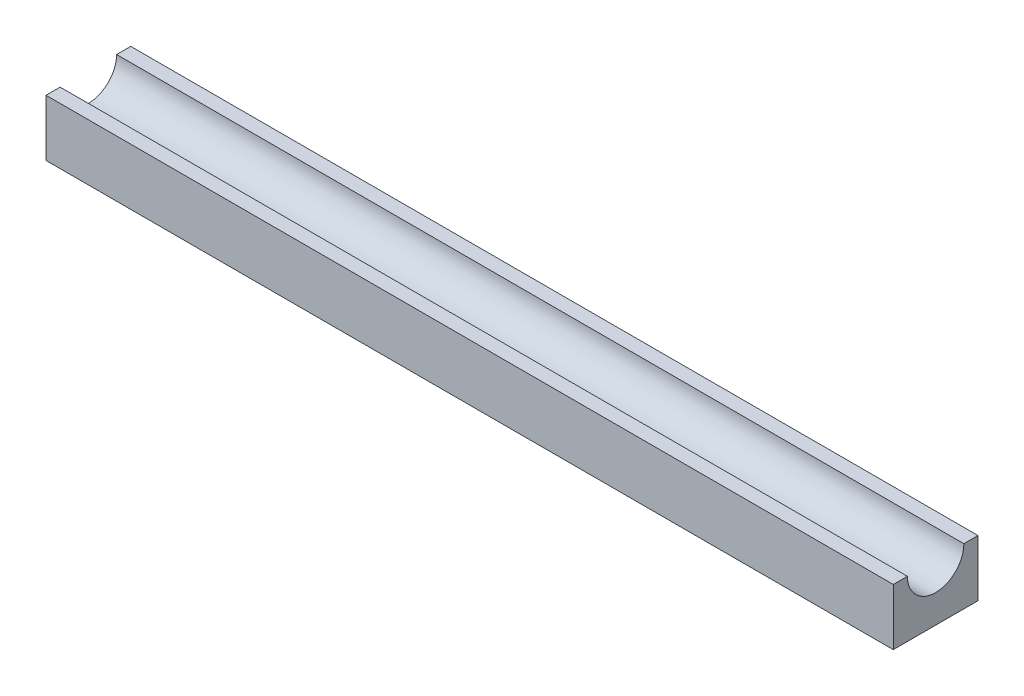
ISO-10303-21;
HEADER;
FILE_DESCRIPTION(('STEP AP214'),'2;1');
FILE_NAME('part.step','',(''),(''),'','','');
FILE_SCHEMA(('AUTOMOTIVE_DESIGN { 1 0 10303 214 1 1 1 1 }'));
ENDSEC;
DATA;
#1=APPLICATION_CONTEXT('core data for automotive mechanical design processes');
#2=APPLICATION_PROTOCOL_DEFINITION('international standard','automotive_design',2000,#1);
#3=PRODUCT_CONTEXT('',#1,'mechanical');
#4=PRODUCT('Part','Part','',(#3));
#5=PRODUCT_RELATED_PRODUCT_CATEGORY('part','',(#4));
#6=PRODUCT_DEFINITION_FORMATION('','',#4);
#7=PRODUCT_DEFINITION_CONTEXT('part definition',#1,'design');
#8=PRODUCT_DEFINITION('design','',#6,#7);
#9=PRODUCT_DEFINITION_SHAPE('','',#8);
#10=(LENGTH_UNIT() NAMED_UNIT(*) SI_UNIT(.MILLI.,.METRE.));
#11=(NAMED_UNIT(*) PLANE_ANGLE_UNIT() SI_UNIT($,.RADIAN.));
#12=(NAMED_UNIT(*) SI_UNIT($,.STERADIAN.) SOLID_ANGLE_UNIT());
#13=UNCERTAINTY_MEASURE_WITH_UNIT(LENGTH_MEASURE(1.E-05),#10,'distance_accuracy_value','');
#14=(GEOMETRIC_REPRESENTATION_CONTEXT(3) GLOBAL_UNCERTAINTY_ASSIGNED_CONTEXT((#13)) GLOBAL_UNIT_ASSIGNED_CONTEXT((#10,
#11,#12)) REPRESENTATION_CONTEXT('',''));
#15=CARTESIAN_POINT('',(0.,0.,0.));
#16=DIRECTION('',(0.,0.,1.));
#17=DIRECTION('',(1.,0.,0.));
#18=AXIS2_PLACEMENT_3D('',#15,#16,#17);
#19=CARTESIAN_POINT('',(150.,5.,0.));
#20=DIRECTION('',(-1.,0.,0.));
#21=DIRECTION('',(0.,0.,1.));
#22=AXIS2_PLACEMENT_3D('',#19,#20,#21);
#23=CYLINDRICAL_SURFACE('',#22,5.);
#24=CARTESIAN_POINT('',(0.,5.,0.));
#25=DIRECTION('',(1.,0.,0.));
#26=DIRECTION('',(0.,0.,-1.));
#27=AXIS2_PLACEMENT_3D('',#24,#25,#26);
#28=CIRCLE('',#27,5.);
#29=CARTESIAN_POINT('',(0.,5.,5.));
#30=VERTEX_POINT('',#29);
#31=CARTESIAN_POINT('',(0.,5.,-5.));
#32=VERTEX_POINT('',#31);
#33=EDGE_CURVE('E231',#30,#32,#28,.T.);
#34=ORIENTED_EDGE('',*,*,#33,.F.);
#35=DIRECTION('',(-1.,0.,0.));
#36=VECTOR('',#35,1.);
#37=CARTESIAN_POINT('',(150.,5.,5.));
#38=LINE('',#37,#36);
#39=CARTESIAN_POINT('',(150.,5.,5.));
#40=VERTEX_POINT('',#39);
#41=EDGE_CURVE('E11',#40,#30,#38,.T.);
#42=ORIENTED_EDGE('',*,*,#41,.F.);
#43=CARTESIAN_POINT('',(150.,5.,0.));
#44=DIRECTION('',(1.,0.,0.));
#45=DIRECTION('',(0.,0.,-1.));
#46=AXIS2_PLACEMENT_3D('',#43,#44,#45);
#47=CIRCLE('',#46,5.);
#48=CARTESIAN_POINT('',(150.,5.,-5.));
#49=VERTEX_POINT('',#48);
#50=EDGE_CURVE('E232',#40,#49,#47,.T.);
#51=ORIENTED_EDGE('',*,*,#50,.T.);
#52=DIRECTION('',(-1.,0.,0.));
#53=VECTOR('',#52,1.);
#54=CARTESIAN_POINT('',(150.,5.,-5.));
#55=LINE('',#54,#53);
#56=EDGE_CURVE('E270',#49,#32,#55,.T.);
#57=ORIENTED_EDGE('',*,*,#56,.T.);
#58=EDGE_LOOP('',(#34,#42,#51,#57));
#59=FACE_BOUND('',#58,.T.);
#60=ADVANCED_FACE('F40',(#59),#23,.F.);
#61=CARTESIAN_POINT('',(150.,5.,0.));
#62=DIRECTION('',(0.,1.,0.));
#63=DIRECTION('',(0.,0.,1.));
#64=AXIS2_PLACEMENT_3D('',#61,#62,#63);
#65=PLANE('',#64);
#66=DIRECTION('',(0.,0.,-1.));
#67=VECTOR('',#66,1.);
#68=CARTESIAN_POINT('',(0.,5.,0.));
#69=LINE('',#68,#67);
#70=CARTESIAN_POINT('',(0.,5.,7.5));
#71=VERTEX_POINT('',#70);
#72=EDGE_CURVE('E255',#71,#30,#69,.T.);
#73=ORIENTED_EDGE('',*,*,#72,.F.);
#74=DIRECTION('',(-1.,0.,0.));
#75=VECTOR('',#74,1.);
#76=CARTESIAN_POINT('',(150.,5.,7.5));
#77=LINE('',#76,#75);
#78=CARTESIAN_POINT('',(150.,5.,7.5));
#79=VERTEX_POINT('',#78);
#80=EDGE_CURVE('E49',#79,#71,#77,.T.);
#81=ORIENTED_EDGE('',*,*,#80,.F.);
#82=DIRECTION('',(0.,0.,-1.));
#83=VECTOR('',#82,1.);
#84=CARTESIAN_POINT('',(150.,5.,0.));
#85=LINE('',#84,#83);
#86=EDGE_CURVE('E236',#79,#40,#85,.T.);
#87=ORIENTED_EDGE('',*,*,#86,.T.);
#88=ORIENTED_EDGE('',*,*,#41,.T.);
#89=EDGE_LOOP('',(#73,#81,#87,#88));
#90=FACE_BOUND('',#89,.T.);
#91=ADVANCED_FACE('F328',(#90),#65,.T.);
#92=CARTESIAN_POINT('',(150.,0.,7.5));
#93=DIRECTION('',(0.,0.,-1.));
#94=DIRECTION('',(0.,1.,0.));
#95=AXIS2_PLACEMENT_3D('',#92,#93,#94);
#96=PLANE('',#95);
#97=DIRECTION('',(0.,-1.,0.));
#98=VECTOR('',#97,1.);
#99=CARTESIAN_POINT('',(0.,0.,7.5));
#100=LINE('',#99,#98);
#101=CARTESIAN_POINT('',(0.,-5.,7.5));
#102=VERTEX_POINT('',#101);
#103=EDGE_CURVE('E259',#71,#102,#100,.T.);
#104=ORIENTED_EDGE('',*,*,#103,.T.);
#105=DIRECTION('',(-1.,0.,0.));
#106=VECTOR('',#105,1.);
#107=CARTESIAN_POINT('',(150.,-5.,7.5));
#108=LINE('',#107,#106);
#109=CARTESIAN_POINT('',(150.,-5.,7.5));
#110=VERTEX_POINT('',#109);
#111=EDGE_CURVE('E279',#110,#102,#108,.T.);
#112=ORIENTED_EDGE('',*,*,#111,.F.);
#113=DIRECTION('',(0.,-1.,0.));
#114=VECTOR('',#113,1.);
#115=CARTESIAN_POINT('',(150.,0.,7.5));
#116=LINE('',#115,#114);
#117=EDGE_CURVE('E241',#79,#110,#116,.T.);
#118=ORIENTED_EDGE('',*,*,#117,.F.);
#119=ORIENTED_EDGE('',*,*,#80,.T.);
#120=EDGE_LOOP('',(#104,#112,#118,#119));
#121=FACE_BOUND('',#120,.T.);
#122=ADVANCED_FACE('F333',(#121),#96,.F.);
#123=CARTESIAN_POINT('',(150.,-5.,0.));
#124=DIRECTION('',(0.,1.,0.));
#125=DIRECTION('',(0.,0.,1.));
#126=AXIS2_PLACEMENT_3D('',#123,#124,#125);
#127=PLANE('',#126);
#128=DIRECTION('',(0.,0.,-1.));
#129=VECTOR('',#128,1.);
#130=CARTESIAN_POINT('',(12.5,-5.00000000000001,1.5));
#131=LINE('',#130,#129);
#132=CARTESIAN_POINT('',(12.5,-5.,1.5));
#133=VERTEX_POINT('',#132);
#134=CARTESIAN_POINT('',(12.5,-5.,-1.5));
#135=VERTEX_POINT('',#134);
#136=EDGE_CURVE('E62',#133,#135,#131,.T.);
#137=ORIENTED_EDGE('',*,*,#136,.F.);
#138=DIRECTION('',(-1.,0.,0.));
#139=VECTOR('',#138,1.);
#140=CARTESIAN_POINT('',(90.,-5.00000000000001,1.50000000000001));
#141=LINE('',#140,#139);
#142=CARTESIAN_POINT('',(17.5,-5.,1.5));
#143=VERTEX_POINT('',#142);
#144=EDGE_CURVE('E57',#143,#133,#141,.T.);
#145=ORIENTED_EDGE('',*,*,#144,.F.);
#146=DIRECTION('',(0.,0.,-1.));
#147=VECTOR('',#146,1.);
#148=CARTESIAN_POINT('',(17.5,-5.00000000000001,1.5));
#149=LINE('',#148,#147);
#150=CARTESIAN_POINT('',(17.5,-5.00000000000001,-1.5));
#151=VERTEX_POINT('',#150);
#152=EDGE_CURVE('E184',#143,#151,#149,.T.);
#153=ORIENTED_EDGE('',*,*,#152,.T.);
#154=DIRECTION('',(-1.,0.,0.));
#155=VECTOR('',#154,1.);
#156=CARTESIAN_POINT('',(90.,-5.00000000000001,-1.49999999999999));
#157=LINE('',#156,#155);
#158=EDGE_CURVE('E172',#151,#135,#157,.T.);
#159=ORIENTED_EDGE('',*,*,#158,.T.);
#160=EDGE_LOOP('',(#137,#145,#153,#159));
#161=FACE_BOUND('',#160,.T.);
#162=DIRECTION('',(0.,0.,-1.));
#163=VECTOR('',#162,1.);
#164=CARTESIAN_POINT('',(72.5,-5.00000000000001,1.5));
#165=LINE('',#164,#163);
#166=CARTESIAN_POINT('',(72.5,-5.,1.5));
#167=VERTEX_POINT('',#166);
#168=CARTESIAN_POINT('',(72.5,-5.,-1.5));
#169=VERTEX_POINT('',#168);
#170=EDGE_CURVE('E203',#167,#169,#165,.T.);
#171=ORIENTED_EDGE('',*,*,#170,.F.);
#172=DIRECTION('',(1.,0.,0.));
#173=VECTOR('',#172,1.);
#174=CARTESIAN_POINT('',(0.,-5.00000000000001,1.5));
#175=LINE('',#174,#173);
#176=CARTESIAN_POINT('',(77.5,-5.,1.5));
#177=VERTEX_POINT('',#176);
#178=EDGE_CURVE('E200',#167,#177,#175,.T.);
#179=ORIENTED_EDGE('',*,*,#178,.T.);
#180=DIRECTION('',(0.,0.,-1.));
#181=VECTOR('',#180,1.);
#182=CARTESIAN_POINT('',(77.5,-5.00000000000001,1.5));
#183=LINE('',#182,#181);
#184=CARTESIAN_POINT('',(77.5,-5.00000000000001,-1.5));
#185=VERTEX_POINT('',#184);
#186=EDGE_CURVE('E221',#177,#185,#183,.T.);
#187=ORIENTED_EDGE('',*,*,#186,.T.);
#188=DIRECTION('',(1.,0.,0.));
#189=VECTOR('',#188,1.);
#190=CARTESIAN_POINT('',(0.,-5.00000000000001,-1.5));
#191=LINE('',#190,#189);
#192=EDGE_CURVE('E193',#169,#185,#191,.T.);
#193=ORIENTED_EDGE('',*,*,#192,.F.);
#194=EDGE_LOOP('',(#171,#179,#187,#193));
#195=FACE_BOUND('',#194,.T.);
#196=DIRECTION('',(0.,0.,-1.));
#197=VECTOR('',#196,1.);
#198=CARTESIAN_POINT('',(0.,-5.,0.));
#199=LINE('',#198,#197);
#200=CARTESIAN_POINT('',(0.,-5.,-7.5));
#201=VERTEX_POINT('',#200);
#202=EDGE_CURVE('E262',#102,#201,#199,.T.);
#203=ORIENTED_EDGE('',*,*,#202,.T.);
#204=DIRECTION('',(-1.,0.,0.));
#205=VECTOR('',#204,1.);
#206=CARTESIAN_POINT('',(150.,-5.,-7.5));
#207=LINE('',#206,#205);
#208=CARTESIAN_POINT('',(150.,-5.,-7.5));
#209=VERTEX_POINT('',#208);
#210=EDGE_CURVE('E276',#209,#201,#207,.T.);
#211=ORIENTED_EDGE('',*,*,#210,.F.);
#212=DIRECTION('',(0.,0.,-1.));
#213=VECTOR('',#212,1.);
#214=CARTESIAN_POINT('',(150.,-5.,0.));
#215=LINE('',#214,#213);
#216=EDGE_CURVE('E245',#110,#209,#215,.T.);
#217=ORIENTED_EDGE('',*,*,#216,.F.);
#218=ORIENTED_EDGE('',*,*,#111,.T.);
#219=EDGE_LOOP('',(#203,#211,#217,#218));
#220=FACE_BOUND('',#219,.T.);
#221=ADVANCED_FACE('F309',(#161,#195,#220),#127,.F.);
#222=CARTESIAN_POINT('',(150.,0.,-7.5));
#223=DIRECTION('',(0.,0.,-1.));
#224=DIRECTION('',(0.,1.,0.));
#225=AXIS2_PLACEMENT_3D('',#222,#223,#224);
#226=PLANE('',#225);
#227=DIRECTION('',(0.,-1.,0.));
#228=VECTOR('',#227,1.);
#229=CARTESIAN_POINT('',(0.,0.,-7.5));
#230=LINE('',#229,#228);
#231=CARTESIAN_POINT('',(0.,5.,-7.5));
#232=VERTEX_POINT('',#231);
#233=EDGE_CURVE('E266',#232,#201,#230,.T.);
#234=ORIENTED_EDGE('',*,*,#233,.F.);
#235=DIRECTION('',(-1.,0.,0.));
#236=VECTOR('',#235,1.);
#237=CARTESIAN_POINT('',(150.,5.,-7.5));
#238=LINE('',#237,#236);
#239=CARTESIAN_POINT('',(150.,5.,-7.5));
#240=VERTEX_POINT('',#239);
#241=EDGE_CURVE('E273',#240,#232,#238,.T.);
#242=ORIENTED_EDGE('',*,*,#241,.F.);
#243=DIRECTION('',(0.,-1.,0.));
#244=VECTOR('',#243,1.);
#245=CARTESIAN_POINT('',(150.,0.,-7.5));
#246=LINE('',#245,#244);
#247=EDGE_CURVE('E248',#240,#209,#246,.T.);
#248=ORIENTED_EDGE('',*,*,#247,.T.);
#249=ORIENTED_EDGE('',*,*,#210,.T.);
#250=EDGE_LOOP('',(#234,#242,#248,#249));
#251=FACE_BOUND('',#250,.T.);
#252=ADVANCED_FACE('F359',(#251),#226,.T.);
#253=EDGE_CURVE('E237',#32,#232,#69,.T.);
#254=ORIENTED_EDGE('',*,*,#253,.F.);
#255=ORIENTED_EDGE('',*,*,#56,.F.);
#256=EDGE_CURVE('E242',#49,#240,#85,.T.);
#257=ORIENTED_EDGE('',*,*,#256,.T.);
#258=ORIENTED_EDGE('',*,*,#241,.T.);
#259=EDGE_LOOP('',(#254,#255,#257,#258));
#260=FACE_BOUND('',#259,.T.);
#261=ADVANCED_FACE('F336',(#260),#65,.T.);
#262=CARTESIAN_POINT('',(150.,0.,0.));
#263=DIRECTION('',(1.,0.,0.));
#264=DIRECTION('',(0.,0.,-1.));
#265=AXIS2_PLACEMENT_3D('',#262,#263,#264);
#266=PLANE('',#265);
#267=ORIENTED_EDGE('',*,*,#50,.F.);
#268=ORIENTED_EDGE('',*,*,#86,.F.);
#269=ORIENTED_EDGE('',*,*,#117,.T.);
#270=ORIENTED_EDGE('',*,*,#216,.T.);
#271=ORIENTED_EDGE('',*,*,#247,.F.);
#272=ORIENTED_EDGE('',*,*,#256,.F.);
#273=EDGE_LOOP('',(#267,#268,#269,#270,#271,#272));
#274=FACE_BOUND('',#273,.T.);
#275=ADVANCED_FACE('F349',(#274),#266,.T.);
#276=CARTESIAN_POINT('',(0.,0.,0.));
#277=DIRECTION('',(1.,0.,0.));
#278=DIRECTION('',(0.,0.,-1.));
#279=AXIS2_PLACEMENT_3D('',#276,#277,#278);
#280=PLANE('',#279);
#281=ORIENTED_EDGE('',*,*,#33,.T.);
#282=ORIENTED_EDGE('',*,*,#253,.T.);
#283=ORIENTED_EDGE('',*,*,#233,.T.);
#284=ORIENTED_EDGE('',*,*,#202,.F.);
#285=ORIENTED_EDGE('',*,*,#103,.F.);
#286=ORIENTED_EDGE('',*,*,#72,.T.);
#287=EDGE_LOOP('',(#281,#282,#283,#284,#285,#286));
#288=FACE_BOUND('',#287,.T.);
#289=ADVANCED_FACE('F344',(#288),#280,.F.);
#290=CARTESIAN_POINT('',(72.5,0.,1.5));
#291=DIRECTION('',(1.,0.,0.));
#292=DIRECTION('',(0.,0.,-1.));
#293=AXIS2_PLACEMENT_3D('',#290,#291,#292);
#294=PLANE('',#293);
#295=DIRECTION('',(0.,-1.,0.));
#296=VECTOR('',#295,1.);
#297=CARTESIAN_POINT('',(72.5,0.,-1.5));
#298=LINE('',#297,#296);
#299=CARTESIAN_POINT('',(72.5,-8.,-1.5));
#300=VERTEX_POINT('',#299);
#301=EDGE_CURVE('E187',#169,#300,#298,.T.);
#302=ORIENTED_EDGE('',*,*,#301,.T.);
#303=DIRECTION('',(0.,0.,-1.));
#304=VECTOR('',#303,1.);
#305=CARTESIAN_POINT('',(72.5,-8.,1.5));
#306=LINE('',#305,#304);
#307=CARTESIAN_POINT('',(72.5,-8.,1.5));
#308=VERTEX_POINT('',#307);
#309=EDGE_CURVE('E227',#308,#300,#306,.T.);
#310=ORIENTED_EDGE('',*,*,#309,.F.);
#311=DIRECTION('',(0.,-1.,0.));
#312=VECTOR('',#311,1.);
#313=CARTESIAN_POINT('',(72.5,0.,1.5));
#314=LINE('',#313,#312);
#315=EDGE_CURVE('E188',#167,#308,#314,.T.);
#316=ORIENTED_EDGE('',*,*,#315,.F.);
#317=ORIENTED_EDGE('',*,*,#170,.T.);
#318=EDGE_LOOP('',(#302,#310,#316,#317));
#319=FACE_BOUND('',#318,.T.);
#320=ADVANCED_FACE('F375',(#319),#294,.F.);
#321=CARTESIAN_POINT('',(75.,-8.,1.5));
#322=DIRECTION('',(0.,0.,-1.));
#323=DIRECTION('',(-1.,0.,0.));
#324=AXIS2_PLACEMENT_3D('',#321,#322,#323);
#325=CYLINDRICAL_SURFACE('',#324,2.50000000000001);
#326=CARTESIAN_POINT('',(75.,-8.,-1.5));
#327=DIRECTION('',(0.,0.,1.));
#328=DIRECTION('',(1.,0.,0.));
#329=AXIS2_PLACEMENT_3D('',#326,#327,#328);
#330=CIRCLE('',#329,2.50000000000001);
#331=CARTESIAN_POINT('',(77.5,-8.,-1.5));
#332=VERTEX_POINT('',#331);
#333=EDGE_CURVE('E207',#300,#332,#330,.T.);
#334=ORIENTED_EDGE('',*,*,#333,.T.);
#335=DIRECTION('',(0.,0.,-1.));
#336=VECTOR('',#335,1.);
#337=CARTESIAN_POINT('',(77.5,-8.,1.5));
#338=LINE('',#337,#336);
#339=CARTESIAN_POINT('',(77.5,-8.,1.5));
#340=VERTEX_POINT('',#339);
#341=EDGE_CURVE('E224',#340,#332,#338,.T.);
#342=ORIENTED_EDGE('',*,*,#341,.F.);
#343=CARTESIAN_POINT('',(75.,-8.,1.5));
#344=DIRECTION('',(0.,0.,1.));
#345=DIRECTION('',(1.,0.,0.));
#346=AXIS2_PLACEMENT_3D('',#343,#344,#345);
#347=CIRCLE('',#346,2.50000000000001);
#348=EDGE_CURVE('E192',#308,#340,#347,.T.);
#349=ORIENTED_EDGE('',*,*,#348,.F.);
#350=ORIENTED_EDGE('',*,*,#309,.T.);
#351=EDGE_LOOP('',(#334,#342,#349,#350));
#352=FACE_BOUND('',#351,.T.);
#353=ADVANCED_FACE('F380',(#352),#325,.T.);
#354=CARTESIAN_POINT('',(77.5,0.,1.5));
#355=DIRECTION('',(1.,0.,0.));
#356=DIRECTION('',(0.,0.,-1.));
#357=AXIS2_PLACEMENT_3D('',#354,#355,#356);
#358=PLANE('',#357);
#359=DIRECTION('',(0.,-1.,0.));
#360=VECTOR('',#359,1.);
#361=CARTESIAN_POINT('',(77.5,0.,-1.5));
#362=LINE('',#361,#360);
#363=EDGE_CURVE('E211',#185,#332,#362,.T.);
#364=ORIENTED_EDGE('',*,*,#363,.F.);
#365=ORIENTED_EDGE('',*,*,#186,.F.);
#366=DIRECTION('',(0.,-1.,0.));
#367=VECTOR('',#366,1.);
#368=CARTESIAN_POINT('',(77.5,0.,1.5));
#369=LINE('',#368,#367);
#370=EDGE_CURVE('E196',#177,#340,#369,.T.);
#371=ORIENTED_EDGE('',*,*,#370,.T.);
#372=ORIENTED_EDGE('',*,*,#341,.T.);
#373=EDGE_LOOP('',(#364,#365,#371,#372));
#374=FACE_BOUND('',#373,.T.);
#375=ADVANCED_FACE('F384',(#374),#358,.T.);
#376=CARTESIAN_POINT('',(0.,0.,1.5));
#377=DIRECTION('',(0.,0.,1.));
#378=DIRECTION('',(1.,0.,0.));
#379=AXIS2_PLACEMENT_3D('',#376,#377,#378);
#380=PLANE('',#379);
#381=CARTESIAN_POINT('',(75.,-8.,1.5));
#382=DIRECTION('',(0.,0.,1.));
#383=DIRECTION('',(1.,0.,0.));
#384=AXIS2_PLACEMENT_3D('',#381,#382,#383);
#385=CIRCLE('',#384,0.499999999999999);
#386=CARTESIAN_POINT('',(75.5,-8.,1.5));
#387=VERTEX_POINT('',#386);
#388=EDGE_CURVE('E173',#387,#387,#385,.T.);
#389=ORIENTED_EDGE('',*,*,#388,.F.);
#390=EDGE_LOOP('',(#389));
#391=FACE_BOUND('',#390,.T.);
#392=ORIENTED_EDGE('',*,*,#315,.T.);
#393=ORIENTED_EDGE('',*,*,#348,.T.);
#394=ORIENTED_EDGE('',*,*,#370,.F.);
#395=ORIENTED_EDGE('',*,*,#178,.F.);
#396=EDGE_LOOP('',(#392,#393,#394,#395));
#397=FACE_BOUND('',#396,.T.);
#398=ADVANCED_FACE('F388',(#391,#397),#380,.T.);
#399=CARTESIAN_POINT('',(0.,0.,-1.5));
#400=DIRECTION('',(0.,0.,1.));
#401=DIRECTION('',(1.,0.,0.));
#402=AXIS2_PLACEMENT_3D('',#399,#400,#401);
#403=PLANE('',#402);
#404=CARTESIAN_POINT('',(75.,-8.,-1.5));
#405=DIRECTION('',(0.,0.,1.));
#406=DIRECTION('',(1.,0.,0.));
#407=AXIS2_PLACEMENT_3D('',#404,#405,#406);
#408=CIRCLE('',#407,0.499999999999999);
#409=CARTESIAN_POINT('',(75.5,-8.,-1.5));
#410=VERTEX_POINT('',#409);
#411=EDGE_CURVE('E284',#410,#410,#408,.T.);
#412=ORIENTED_EDGE('',*,*,#411,.T.);
#413=EDGE_LOOP('',(#412));
#414=FACE_BOUND('',#413,.T.);
#415=ORIENTED_EDGE('',*,*,#301,.F.);
#416=ORIENTED_EDGE('',*,*,#192,.T.);
#417=ORIENTED_EDGE('',*,*,#363,.T.);
#418=ORIENTED_EDGE('',*,*,#333,.F.);
#419=EDGE_LOOP('',(#415,#416,#417,#418));
#420=FACE_BOUND('',#419,.T.);
#421=ADVANCED_FACE('F390',(#414,#420),#403,.F.);
#422=CARTESIAN_POINT('',(17.5,0.,1.5));
#423=DIRECTION('',(1.,0.,0.));
#424=DIRECTION('',(0.,0.,-1.));
#425=AXIS2_PLACEMENT_3D('',#422,#423,#424);
#426=PLANE('',#425);
#427=DIRECTION('',(0.,-1.,0.));
#428=VECTOR('',#427,1.);
#429=CARTESIAN_POINT('',(17.5,0.,-1.5));
#430=LINE('',#429,#428);
#431=CARTESIAN_POINT('',(17.5,-8.,-1.5));
#432=VERTEX_POINT('',#431);
#433=EDGE_CURVE('E168',#151,#432,#430,.T.);
#434=ORIENTED_EDGE('',*,*,#433,.F.);
#435=ORIENTED_EDGE('',*,*,#152,.F.);
#436=DIRECTION('',(0.,-1.,0.));
#437=VECTOR('',#436,1.);
#438=CARTESIAN_POINT('',(17.5,0.,1.5));
#439=LINE('',#438,#437);
#440=CARTESIAN_POINT('',(17.5,-8.,1.5));
#441=VERTEX_POINT('',#440);
#442=EDGE_CURVE('E180',#143,#441,#439,.T.);
#443=ORIENTED_EDGE('',*,*,#442,.T.);
#444=DIRECTION('',(0.,0.,-1.));
#445=VECTOR('',#444,1.);
#446=CARTESIAN_POINT('',(17.5,-8.,1.5));
#447=LINE('',#446,#445);
#448=EDGE_CURVE('E158',#441,#432,#447,.T.);
#449=ORIENTED_EDGE('',*,*,#448,.T.);
#450=EDGE_LOOP('',(#434,#435,#443,#449));
#451=FACE_BOUND('',#450,.T.);
#452=ADVANCED_FACE('F307',(#451),#426,.T.);
#453=CARTESIAN_POINT('',(12.5,0.,1.5));
#454=DIRECTION('',(1.,0.,0.));
#455=DIRECTION('',(0.,0.,-1.));
#456=AXIS2_PLACEMENT_3D('',#453,#454,#455);
#457=PLANE('',#456);
#458=DIRECTION('',(0.,-1.,0.));
#459=VECTOR('',#458,1.);
#460=CARTESIAN_POINT('',(12.5,0.,-1.5));
#461=LINE('',#460,#459);
#462=CARTESIAN_POINT('',(12.5,-8.,-1.5));
#463=VERTEX_POINT('',#462);
#464=EDGE_CURVE('E153',#135,#463,#461,.T.);
#465=ORIENTED_EDGE('',*,*,#464,.T.);
#466=DIRECTION('',(0.,0.,-1.));
#467=VECTOR('',#466,1.);
#468=CARTESIAN_POINT('',(12.5,-8.,1.5));
#469=LINE('',#468,#467);
#470=CARTESIAN_POINT('',(12.5,-8.,1.5));
#471=VERTEX_POINT('',#470);
#472=EDGE_CURVE('E150',#471,#463,#469,.T.);
#473=ORIENTED_EDGE('',*,*,#472,.F.);
#474=DIRECTION('',(0.,-1.,0.));
#475=VECTOR('',#474,1.);
#476=CARTESIAN_POINT('',(12.5,0.,1.5));
#477=LINE('',#476,#475);
#478=EDGE_CURVE('E140',#133,#471,#477,.T.);
#479=ORIENTED_EDGE('',*,*,#478,.F.);
#480=ORIENTED_EDGE('',*,*,#136,.T.);
#481=EDGE_LOOP('',(#465,#473,#479,#480));
#482=FACE_BOUND('',#481,.T.);
#483=ADVANCED_FACE('F151',(#482),#457,.F.);
#484=CARTESIAN_POINT('',(15.,-8.,1.5));
#485=DIRECTION('',(0.,0.,-1.));
#486=DIRECTION('',(-1.,0.,0.));
#487=AXIS2_PLACEMENT_3D('',#484,#485,#486);
#488=CYLINDRICAL_SURFACE('',#487,2.50000000000001);
#489=CARTESIAN_POINT('',(15.,-8.,-1.5));
#490=DIRECTION('',(0.,0.,-1.));
#491=DIRECTION('',(-1.,0.,0.));
#492=AXIS2_PLACEMENT_3D('',#489,#490,#491);
#493=CIRCLE('',#492,2.50000000000001);
#494=EDGE_CURVE('E178',#432,#463,#493,.T.);
#495=ORIENTED_EDGE('',*,*,#494,.F.);
#496=ORIENTED_EDGE('',*,*,#448,.F.);
#497=CARTESIAN_POINT('',(15.,-8.,1.5));
#498=DIRECTION('',(0.,0.,-1.));
#499=DIRECTION('',(-1.,0.,0.));
#500=AXIS2_PLACEMENT_3D('',#497,#498,#499);
#501=CIRCLE('',#500,2.50000000000001);
#502=EDGE_CURVE('E145',#441,#471,#501,.T.);
#503=ORIENTED_EDGE('',*,*,#502,.T.);
#504=ORIENTED_EDGE('',*,*,#472,.T.);
#505=EDGE_LOOP('',(#495,#496,#503,#504));
#506=FACE_BOUND('',#505,.T.);
#507=ADVANCED_FACE('F160',(#506),#488,.T.);
#508=CARTESIAN_POINT('',(90.,0.,1.50000000000001));
#509=DIRECTION('',(0.,0.,1.));
#510=DIRECTION('',(-1.,0.,0.));
#511=AXIS2_PLACEMENT_3D('',#508,#509,#510);
#512=PLANE('',#511);
#513=CARTESIAN_POINT('',(15.,-8.,1.49999999999999));
#514=DIRECTION('',(0.,0.,1.));
#515=DIRECTION('',(1.,0.,0.));
#516=AXIS2_PLACEMENT_3D('',#513,#514,#515);
#517=CIRCLE('',#516,0.500000000000001);
#518=CARTESIAN_POINT('',(15.5,-8.,1.49999999999999));
#519=VERTEX_POINT('',#518);
#520=EDGE_CURVE('E294',#519,#519,#517,.T.);
#521=ORIENTED_EDGE('',*,*,#520,.F.);
#522=EDGE_LOOP('',(#521));
#523=FACE_BOUND('',#522,.T.);
#524=ORIENTED_EDGE('',*,*,#442,.F.);
#525=ORIENTED_EDGE('',*,*,#144,.T.);
#526=ORIENTED_EDGE('',*,*,#478,.T.);
#527=ORIENTED_EDGE('',*,*,#502,.F.);
#528=EDGE_LOOP('',(#524,#525,#526,#527));
#529=FACE_BOUND('',#528,.T.);
#530=ADVANCED_FACE('F143',(#523,#529),#512,.T.);
#531=CARTESIAN_POINT('',(90.,0.,-1.49999999999999));
#532=DIRECTION('',(0.,0.,1.));
#533=DIRECTION('',(-1.,0.,0.));
#534=AXIS2_PLACEMENT_3D('',#531,#532,#533);
#535=PLANE('',#534);
#536=CARTESIAN_POINT('',(15.,-8.,-1.5));
#537=DIRECTION('',(0.,0.,1.));
#538=DIRECTION('',(1.,0.,0.));
#539=AXIS2_PLACEMENT_3D('',#536,#537,#538);
#540=CIRCLE('',#539,0.500000000000001);
#541=CARTESIAN_POINT('',(15.5,-8.,-1.5));
#542=VERTEX_POINT('',#541);
#543=EDGE_CURVE('E43',#542,#542,#540,.T.);
#544=ORIENTED_EDGE('',*,*,#543,.T.);
#545=EDGE_LOOP('',(#544));
#546=FACE_BOUND('',#545,.T.);
#547=ORIENTED_EDGE('',*,*,#433,.T.);
#548=ORIENTED_EDGE('',*,*,#494,.T.);
#549=ORIENTED_EDGE('',*,*,#464,.F.);
#550=ORIENTED_EDGE('',*,*,#158,.F.);
#551=EDGE_LOOP('',(#547,#548,#549,#550));
#552=FACE_BOUND('',#551,.T.);
#553=ADVANCED_FACE('F312',(#546,#552),#535,.F.);
#554=CARTESIAN_POINT('',(75.,-8.,-7.5));
#555=DIRECTION('',(0.,0.,1.));
#556=DIRECTION('',(1.,0.,0.));
#557=AXIS2_PLACEMENT_3D('',#554,#555,#556);
#558=CYLINDRICAL_SURFACE('',#557,0.499999999999999);
#559=ORIENTED_EDGE('',*,*,#388,.T.);
#560=EDGE_LOOP('',(#559));
#561=FACE_BOUND('',#560,.T.);
#562=ORIENTED_EDGE('',*,*,#411,.F.);
#563=EDGE_LOOP('',(#562));
#564=FACE_BOUND('',#563,.T.);
#565=ADVANCED_FACE('F314',(#561,#564),#558,.F.);
#566=CARTESIAN_POINT('',(15.,-8.,-8.50000000000001));
#567=DIRECTION('',(0.,0.,1.));
#568=DIRECTION('',(1.,0.,0.));
#569=AXIS2_PLACEMENT_3D('',#566,#567,#568);
#570=CYLINDRICAL_SURFACE('',#569,0.500000000000001);
#571=ORIENTED_EDGE('',*,*,#520,.T.);
#572=EDGE_LOOP('',(#571));
#573=FACE_BOUND('',#572,.T.);
#574=ORIENTED_EDGE('',*,*,#543,.F.);
#575=EDGE_LOOP('',(#574));
#576=FACE_BOUND('',#575,.T.);
#577=ADVANCED_FACE('F321',(#573,#576),#570,.F.);
#578=CLOSED_SHELL('',(#60,#91,#122,#221,#252,#261,#275,#289,#320,#353,#375,#398,#421,#452,#483,
#507,#530,#553,#565,#577));
#579=MANIFOLD_SOLID_BREP('B2',#578);
#580=ADVANCED_BREP_SHAPE_REPRESENTATION('',(#18,#579),#14);
#581=SHAPE_DEFINITION_REPRESENTATION(#9,#580);
ENDSEC;
END-ISO-10303-21;
